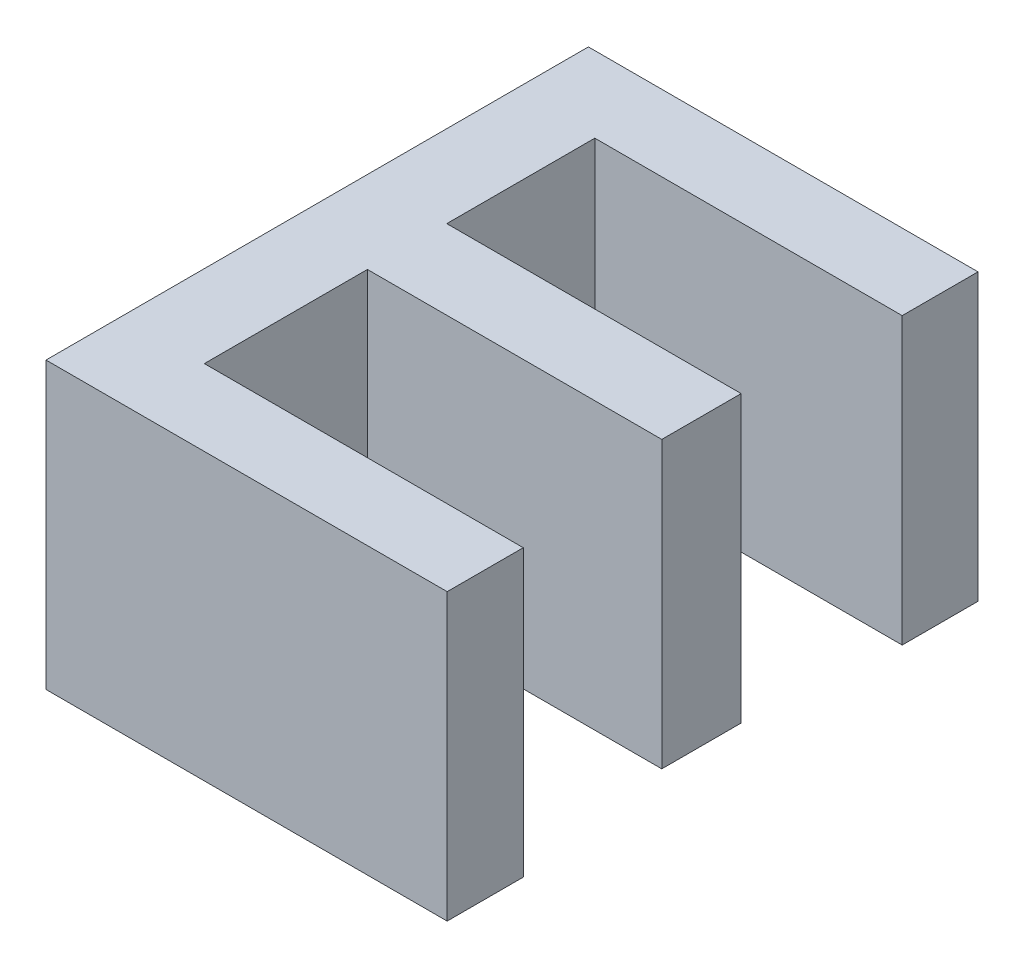
ISO-10303-21;
HEADER;
FILE_DESCRIPTION(('STEP AP214'),'2;1');
FILE_NAME('part.step','',(''),(''),'','','');
FILE_SCHEMA(('AUTOMOTIVE_DESIGN { 1 0 10303 214 1 1 1 1 }'));
ENDSEC;
DATA;
#1=APPLICATION_CONTEXT('core data for automotive mechanical design processes');
#2=APPLICATION_PROTOCOL_DEFINITION('international standard','automotive_design',2000,#1);
#3=PRODUCT_CONTEXT('',#1,'mechanical');
#4=PRODUCT('Part','Part','',(#3));
#5=PRODUCT_RELATED_PRODUCT_CATEGORY('part','',(#4));
#6=PRODUCT_DEFINITION_FORMATION('','',#4);
#7=PRODUCT_DEFINITION_CONTEXT('part definition',#1,'design');
#8=PRODUCT_DEFINITION('design','',#6,#7);
#9=PRODUCT_DEFINITION_SHAPE('','',#8);
#10=(LENGTH_UNIT() NAMED_UNIT(*) SI_UNIT(.MILLI.,.METRE.));
#11=(NAMED_UNIT(*) PLANE_ANGLE_UNIT() SI_UNIT($,.RADIAN.));
#12=(NAMED_UNIT(*) SI_UNIT($,.STERADIAN.) SOLID_ANGLE_UNIT());
#13=UNCERTAINTY_MEASURE_WITH_UNIT(LENGTH_MEASURE(1.E-05),#10,'distance_accuracy_value','');
#14=(GEOMETRIC_REPRESENTATION_CONTEXT(3) GLOBAL_UNCERTAINTY_ASSIGNED_CONTEXT((#13)) GLOBAL_UNIT_ASSIGNED_CONTEXT((#10,
#11,#12)) REPRESENTATION_CONTEXT('',''));
#15=CARTESIAN_POINT('',(0.,0.,0.));
#16=DIRECTION('',(0.,0.,1.));
#17=DIRECTION('',(1.,0.,0.));
#18=AXIS2_PLACEMENT_3D('',#15,#16,#17);
#19=CARTESIAN_POINT('',(78.3719416946208,10.,-58.9556493619376));
#20=DIRECTION('',(-1.,0.,0.));
#21=DIRECTION('',(0.,0.,1.));
#22=AXIS2_PLACEMENT_3D('',#19,#20,#21);
#23=PLANE('',#22);
#24=DIRECTION('',(0.,0.,-1.));
#25=VECTOR('',#24,1.);
#26=CARTESIAN_POINT('',(78.3719416946208,0.,-58.9556493619376));
#27=LINE('',#26,#25);
#28=CARTESIAN_POINT('',(78.3719416946208,0.,-56.28859622837));
#29=VERTEX_POINT('',#28);
#30=CARTESIAN_POINT('',(78.3719416946208,0.,-58.9556493619376));
#31=VERTEX_POINT('',#30);
#32=EDGE_CURVE('E150',#29,#31,#27,.T.);
#33=ORIENTED_EDGE('',*,*,#32,.T.);
#34=DIRECTION('',(0.,-1.,0.));
#35=VECTOR('',#34,1.);
#36=CARTESIAN_POINT('',(78.3719416946208,10.,-58.9556493619376));
#37=LINE('',#36,#35);
#38=CARTESIAN_POINT('',(78.3719416946208,10.,-58.9556493619376));
#39=VERTEX_POINT('',#38);
#40=EDGE_CURVE('E11',#39,#31,#37,.T.);
#41=ORIENTED_EDGE('',*,*,#40,.F.);
#42=DIRECTION('',(0.,0.,-1.));
#43=VECTOR('',#42,1.);
#44=CARTESIAN_POINT('',(78.3719416946208,10.,-58.9556493619376));
#45=LINE('',#44,#43);
#46=CARTESIAN_POINT('',(78.3719416946208,10.,-56.28859622837));
#47=VERTEX_POINT('',#46);
#48=EDGE_CURVE('E172',#47,#39,#45,.T.);
#49=ORIENTED_EDGE('',*,*,#48,.F.);
#50=DIRECTION('',(0.,-1.,0.));
#51=VECTOR('',#50,1.);
#52=CARTESIAN_POINT('',(78.3719416946208,10.,-56.28859622837));
#53=LINE('',#52,#51);
#54=EDGE_CURVE('E146',#47,#29,#53,.T.);
#55=ORIENTED_EDGE('',*,*,#54,.T.);
#56=EDGE_LOOP('',(#33,#41,#49,#55));
#57=FACE_BOUND('',#56,.T.);
#58=ADVANCED_FACE('F30',(#57),#23,.F.);
#59=CARTESIAN_POINT('',(67.1950137308941,10.,-58.9556493619376));
#60=DIRECTION('',(0.,0.,1.));
#61=DIRECTION('',(1.,0.,0.));
#62=AXIS2_PLACEMENT_3D('',#59,#60,#61);
#63=PLANE('',#62);
#64=DIRECTION('',(-1.,0.,0.));
#65=VECTOR('',#64,1.);
#66=CARTESIAN_POINT('',(67.1950137308941,0.,-58.9556493619376));
#67=LINE('',#66,#65);
#68=CARTESIAN_POINT('',(67.1950137308941,0.,-58.9556493619376));
#69=VERTEX_POINT('',#68);
#70=EDGE_CURVE('E153',#31,#69,#67,.T.);
#71=ORIENTED_EDGE('',*,*,#70,.T.);
#72=DIRECTION('',(0.,-1.,0.));
#73=VECTOR('',#72,1.);
#74=CARTESIAN_POINT('',(67.1950137308941,10.,-58.9556493619376));
#75=LINE('',#74,#73);
#76=CARTESIAN_POINT('',(67.1950137308941,10.,-58.9556493619376));
#77=VERTEX_POINT('',#76);
#78=EDGE_CURVE('E38',#77,#69,#75,.T.);
#79=ORIENTED_EDGE('',*,*,#78,.F.);
#80=DIRECTION('',(-1.,0.,0.));
#81=VECTOR('',#80,1.);
#82=CARTESIAN_POINT('',(67.1950137308941,10.,-58.9556493619376));
#83=LINE('',#82,#81);
#84=EDGE_CURVE('E101',#39,#77,#83,.T.);
#85=ORIENTED_EDGE('',*,*,#84,.F.);
#86=ORIENTED_EDGE('',*,*,#40,.T.);
#87=EDGE_LOOP('',(#71,#79,#85,#86));
#88=FACE_BOUND('',#87,.T.);
#89=ADVANCED_FACE('F250',(#88),#63,.F.);
#90=CARTESIAN_POINT('',(67.1950137308941,10.,-64.6705491804947));
#91=DIRECTION('',(-1.,0.,0.));
#92=DIRECTION('',(0.,0.,1.));
#93=AXIS2_PLACEMENT_3D('',#90,#91,#92);
#94=PLANE('',#93);
#95=DIRECTION('',(0.,0.,-1.));
#96=VECTOR('',#95,1.);
#97=CARTESIAN_POINT('',(67.1950137308941,0.,-64.6705491804947));
#98=LINE('',#97,#96);
#99=CARTESIAN_POINT('',(67.1950137308941,0.,-64.6705491804947));
#100=VERTEX_POINT('',#99);
#101=EDGE_CURVE('E155',#69,#100,#98,.T.);
#102=ORIENTED_EDGE('',*,*,#101,.T.);
#103=DIRECTION('',(0.,-1.,0.));
#104=VECTOR('',#103,1.);
#105=CARTESIAN_POINT('',(67.1950137308941,10.,-64.6705491804947));
#106=LINE('',#105,#104);
#107=CARTESIAN_POINT('',(67.1950137308941,10.,-64.6705491804947));
#108=VERTEX_POINT('',#107);
#109=EDGE_CURVE('E191',#108,#100,#106,.T.);
#110=ORIENTED_EDGE('',*,*,#109,.F.);
#111=DIRECTION('',(0.,0.,-1.));
#112=VECTOR('',#111,1.);
#113=CARTESIAN_POINT('',(67.1950137308941,10.,-64.6705491804947));
#114=LINE('',#113,#112);
#115=EDGE_CURVE('E199',#77,#108,#114,.T.);
#116=ORIENTED_EDGE('',*,*,#115,.F.);
#117=ORIENTED_EDGE('',*,*,#78,.T.);
#118=EDGE_LOOP('',(#102,#110,#116,#117));
#119=FACE_BOUND('',#118,.T.);
#120=ADVANCED_FACE('F197',(#119),#94,.F.);
#121=CARTESIAN_POINT('',(77.5121780051033,10.,-64.6705491804947));
#122=DIRECTION('',(0.,0.,-1.));
#123=DIRECTION('',(-1.,0.,0.));
#124=AXIS2_PLACEMENT_3D('',#121,#122,#123);
#125=PLANE('',#124);
#126=DIRECTION('',(1.,0.,0.));
#127=VECTOR('',#126,1.);
#128=CARTESIAN_POINT('',(77.5121780051033,0.,-64.6705491804947));
#129=LINE('',#128,#127);
#130=CARTESIAN_POINT('',(77.5121780051033,0.,-64.6705491804947));
#131=VERTEX_POINT('',#130);
#132=EDGE_CURVE('E157',#100,#131,#129,.T.);
#133=ORIENTED_EDGE('',*,*,#132,.T.);
#134=DIRECTION('',(0.,-1.,0.));
#135=VECTOR('',#134,1.);
#136=CARTESIAN_POINT('',(77.5121780051033,10.,-64.6705491804947));
#137=LINE('',#136,#135);
#138=CARTESIAN_POINT('',(77.5121780051033,10.,-64.6705491804947));
#139=VERTEX_POINT('',#138);
#140=EDGE_CURVE('E188',#139,#131,#137,.T.);
#141=ORIENTED_EDGE('',*,*,#140,.F.);
#142=DIRECTION('',(1.,0.,0.));
#143=VECTOR('',#142,1.);
#144=CARTESIAN_POINT('',(77.5121780051033,10.,-64.6705491804947));
#145=LINE('',#144,#143);
#146=EDGE_CURVE('E217',#108,#139,#145,.T.);
#147=ORIENTED_EDGE('',*,*,#146,.F.);
#148=ORIENTED_EDGE('',*,*,#109,.T.);
#149=EDGE_LOOP('',(#133,#141,#147,#148));
#150=FACE_BOUND('',#149,.T.);
#151=ADVANCED_FACE('F208',(#150),#125,.F.);
#152=CARTESIAN_POINT('',(77.5121780051033,10.,-67.452137587757));
#153=DIRECTION('',(-1.,0.,0.));
#154=DIRECTION('',(0.,0.,1.));
#155=AXIS2_PLACEMENT_3D('',#152,#153,#154);
#156=PLANE('',#155);
#157=DIRECTION('',(0.,0.,-1.));
#158=VECTOR('',#157,1.);
#159=CARTESIAN_POINT('',(77.5121780051033,0.,-67.452137587757));
#160=LINE('',#159,#158);
#161=CARTESIAN_POINT('',(77.5121780051033,0.,-67.452137587757));
#162=VERTEX_POINT('',#161);
#163=EDGE_CURVE('E159',#131,#162,#160,.T.);
#164=ORIENTED_EDGE('',*,*,#163,.T.);
#165=DIRECTION('',(0.,-1.,0.));
#166=VECTOR('',#165,1.);
#167=CARTESIAN_POINT('',(77.5121780051033,10.,-67.452137587757));
#168=LINE('',#167,#166);
#169=CARTESIAN_POINT('',(77.5121780051033,10.,-67.452137587757));
#170=VERTEX_POINT('',#169);
#171=EDGE_CURVE('E185',#170,#162,#168,.T.);
#172=ORIENTED_EDGE('',*,*,#171,.F.);
#173=DIRECTION('',(0.,0.,-1.));
#174=VECTOR('',#173,1.);
#175=CARTESIAN_POINT('',(77.5121780051033,10.,-67.452137587757));
#176=LINE('',#175,#174);
#177=EDGE_CURVE('E214',#139,#170,#176,.T.);
#178=ORIENTED_EDGE('',*,*,#177,.F.);
#179=ORIENTED_EDGE('',*,*,#140,.T.);
#180=EDGE_LOOP('',(#164,#172,#178,#179));
#181=FACE_BOUND('',#180,.T.);
#182=ADVANCED_FACE('F212',(#181),#156,.F.);
#183=CARTESIAN_POINT('',(67.1950137308941,10.,-67.452137587757));
#184=DIRECTION('',(0.,0.,1.));
#185=DIRECTION('',(1.,0.,0.));
#186=AXIS2_PLACEMENT_3D('',#183,#184,#185);
#187=PLANE('',#186);
#188=DIRECTION('',(-1.,0.,0.));
#189=VECTOR('',#188,1.);
#190=CARTESIAN_POINT('',(67.1950137308941,0.,-67.452137587757));
#191=LINE('',#190,#189);
#192=CARTESIAN_POINT('',(67.1950137308941,0.,-67.452137587757));
#193=VERTEX_POINT('',#192);
#194=EDGE_CURVE('E161',#162,#193,#191,.T.);
#195=ORIENTED_EDGE('',*,*,#194,.T.);
#196=DIRECTION('',(0.,-1.,0.));
#197=VECTOR('',#196,1.);
#198=CARTESIAN_POINT('',(67.1950137308941,10.,-67.452137587757));
#199=LINE('',#198,#197);
#200=CARTESIAN_POINT('',(67.1950137308941,10.,-67.452137587757));
#201=VERTEX_POINT('',#200);
#202=EDGE_CURVE('E182',#201,#193,#199,.T.);
#203=ORIENTED_EDGE('',*,*,#202,.F.);
#204=DIRECTION('',(-1.,0.,0.));
#205=VECTOR('',#204,1.);
#206=CARTESIAN_POINT('',(67.1950137308941,10.,-67.452137587757));
#207=LINE('',#206,#205);
#208=EDGE_CURVE('E216',#170,#201,#207,.T.);
#209=ORIENTED_EDGE('',*,*,#208,.F.);
#210=ORIENTED_EDGE('',*,*,#171,.T.);
#211=EDGE_LOOP('',(#195,#203,#209,#210));
#212=FACE_BOUND('',#211,.T.);
#213=ADVANCED_FACE('F263',(#212),#187,.F.);
#214=CARTESIAN_POINT('',(67.1950137308941,10.,-72.6404550002934));
#215=DIRECTION('',(-1.,0.,0.));
#216=DIRECTION('',(0.,0.,1.));
#217=AXIS2_PLACEMENT_3D('',#214,#215,#216);
#218=PLANE('',#217);
#219=DIRECTION('',(0.,0.,-1.));
#220=VECTOR('',#219,1.);
#221=CARTESIAN_POINT('',(67.1950137308941,0.,-72.6404550002934));
#222=LINE('',#221,#220);
#223=CARTESIAN_POINT('',(67.1950137308941,0.,-72.6404550002934));
#224=VERTEX_POINT('',#223);
#225=EDGE_CURVE('E163',#193,#224,#222,.T.);
#226=ORIENTED_EDGE('',*,*,#225,.T.);
#227=DIRECTION('',(0.,-1.,0.));
#228=VECTOR('',#227,1.);
#229=CARTESIAN_POINT('',(67.1950137308941,10.,-72.6404550002934));
#230=LINE('',#229,#228);
#231=CARTESIAN_POINT('',(67.1950137308941,10.,-72.6404550002934));
#232=VERTEX_POINT('',#231);
#233=EDGE_CURVE('E179',#232,#224,#230,.T.);
#234=ORIENTED_EDGE('',*,*,#233,.F.);
#235=DIRECTION('',(0.,0.,-1.));
#236=VECTOR('',#235,1.);
#237=CARTESIAN_POINT('',(67.1950137308941,10.,-72.6404550002934));
#238=LINE('',#237,#236);
#239=EDGE_CURVE('E219',#201,#232,#238,.T.);
#240=ORIENTED_EDGE('',*,*,#239,.F.);
#241=ORIENTED_EDGE('',*,*,#202,.T.);
#242=EDGE_LOOP('',(#226,#234,#240,#241));
#243=FACE_BOUND('',#242,.T.);
#244=ADVANCED_FACE('F266',(#243),#218,.F.);
#245=CARTESIAN_POINT('',(77.9673470172008,10.,-72.6404550002934));
#246=DIRECTION('',(0.,0.,-1.));
#247=DIRECTION('',(-1.,0.,0.));
#248=AXIS2_PLACEMENT_3D('',#245,#246,#247);
#249=PLANE('',#248);
#250=DIRECTION('',(1.,0.,0.));
#251=VECTOR('',#250,1.);
#252=CARTESIAN_POINT('',(77.9673470172008,0.,-72.6404550002934));
#253=LINE('',#252,#251);
#254=CARTESIAN_POINT('',(77.9673470172008,0.,-72.6404550002934));
#255=VERTEX_POINT('',#254);
#256=EDGE_CURVE('E165',#224,#255,#253,.T.);
#257=ORIENTED_EDGE('',*,*,#256,.T.);
#258=DIRECTION('',(0.,-1.,0.));
#259=VECTOR('',#258,1.);
#260=CARTESIAN_POINT('',(77.9673470172008,10.,-72.6404550002934));
#261=LINE('',#260,#259);
#262=CARTESIAN_POINT('',(77.9673470172008,10.,-72.6404550002934));
#263=VERTEX_POINT('',#262);
#264=EDGE_CURVE('E176',#263,#255,#261,.T.);
#265=ORIENTED_EDGE('',*,*,#264,.F.);
#266=DIRECTION('',(1.,0.,0.));
#267=VECTOR('',#266,1.);
#268=CARTESIAN_POINT('',(77.9673470172008,10.,-72.6404550002934));
#269=LINE('',#268,#267);
#270=EDGE_CURVE('E225',#232,#263,#269,.T.);
#271=ORIENTED_EDGE('',*,*,#270,.F.);
#272=ORIENTED_EDGE('',*,*,#233,.T.);
#273=EDGE_LOOP('',(#257,#265,#271,#272));
#274=FACE_BOUND('',#273,.T.);
#275=ADVANCED_FACE('F231',(#274),#249,.F.);
#276=CARTESIAN_POINT('',(77.9673470172008,10.,-75.2974570796293));
#277=DIRECTION('',(-1.,0.,0.));
#278=DIRECTION('',(0.,0.,1.));
#279=AXIS2_PLACEMENT_3D('',#276,#277,#278);
#280=PLANE('',#279);
#281=DIRECTION('',(0.,0.,-1.));
#282=VECTOR('',#281,1.);
#283=CARTESIAN_POINT('',(77.9673470172008,0.,-75.2974570796293));
#284=LINE('',#283,#282);
#285=CARTESIAN_POINT('',(77.9673470172008,0.,-75.2974570796293));
#286=VERTEX_POINT('',#285);
#287=EDGE_CURVE('E167',#255,#286,#284,.T.);
#288=ORIENTED_EDGE('',*,*,#287,.T.);
#289=DIRECTION('',(0.,-1.,0.));
#290=VECTOR('',#289,1.);
#291=CARTESIAN_POINT('',(77.9673470172008,10.,-75.2974570796293));
#292=LINE('',#291,#290);
#293=CARTESIAN_POINT('',(77.9673470172008,10.,-75.2974570796293));
#294=VERTEX_POINT('',#293);
#295=EDGE_CURVE('E141',#294,#286,#292,.T.);
#296=ORIENTED_EDGE('',*,*,#295,.F.);
#297=DIRECTION('',(0.,0.,-1.));
#298=VECTOR('',#297,1.);
#299=CARTESIAN_POINT('',(77.9673470172008,10.,-75.2974570796293));
#300=LINE('',#299,#298);
#301=EDGE_CURVE('E132',#263,#294,#300,.T.);
#302=ORIENTED_EDGE('',*,*,#301,.F.);
#303=ORIENTED_EDGE('',*,*,#264,.T.);
#304=EDGE_LOOP('',(#288,#296,#302,#303));
#305=FACE_BOUND('',#304,.T.);
#306=ADVANCED_FACE('F235',(#305),#280,.F.);
#307=CARTESIAN_POINT('',(64.3122766542768,10.,-75.2974570796293));
#308=DIRECTION('',(0.,0.,1.));
#309=DIRECTION('',(1.,0.,0.));
#310=AXIS2_PLACEMENT_3D('',#307,#308,#309);
#311=PLANE('',#310);
#312=DIRECTION('',(-1.,0.,0.));
#313=VECTOR('',#312,1.);
#314=CARTESIAN_POINT('',(64.3122766542768,0.,-75.2974570796293));
#315=LINE('',#314,#313);
#316=CARTESIAN_POINT('',(64.3122766542768,0.,-75.2974570796293));
#317=VERTEX_POINT('',#316);
#318=EDGE_CURVE('E140',#286,#317,#315,.T.);
#319=ORIENTED_EDGE('',*,*,#318,.T.);
#320=DIRECTION('',(0.,-1.,0.));
#321=VECTOR('',#320,1.);
#322=CARTESIAN_POINT('',(64.3122766542768,10.,-75.2974570796293));
#323=LINE('',#322,#321);
#324=CARTESIAN_POINT('',(64.3122766542768,10.,-75.2974570796293));
#325=VERTEX_POINT('',#324);
#326=EDGE_CURVE('E137',#325,#317,#323,.T.);
#327=ORIENTED_EDGE('',*,*,#326,.F.);
#328=DIRECTION('',(-1.,0.,0.));
#329=VECTOR('',#328,1.);
#330=CARTESIAN_POINT('',(64.3122766542768,10.,-75.2974570796293));
#331=LINE('',#330,#329);
#332=EDGE_CURVE('E126',#294,#325,#331,.T.);
#333=ORIENTED_EDGE('',*,*,#332,.F.);
#334=ORIENTED_EDGE('',*,*,#295,.T.);
#335=EDGE_LOOP('',(#319,#327,#333,#334));
#336=FACE_BOUND('',#335,.T.);
#337=ADVANCED_FACE('F138',(#336),#311,.F.);
#338=CARTESIAN_POINT('',(64.3122766542768,10.,-56.28859622837));
#339=DIRECTION('',(1.,0.,0.));
#340=DIRECTION('',(0.,0.,-1.));
#341=AXIS2_PLACEMENT_3D('',#338,#339,#340);
#342=PLANE('',#341);
#343=DIRECTION('',(0.,0.,1.));
#344=VECTOR('',#343,1.);
#345=CARTESIAN_POINT('',(64.3122766542768,0.,-56.28859622837));
#346=LINE('',#345,#344);
#347=CARTESIAN_POINT('',(64.3122766542768,0.,-56.28859622837));
#348=VERTEX_POINT('',#347);
#349=EDGE_CURVE('E87',#317,#348,#346,.T.);
#350=ORIENTED_EDGE('',*,*,#349,.T.);
#351=DIRECTION('',(0.,-1.,0.));
#352=VECTOR('',#351,1.);
#353=CARTESIAN_POINT('',(64.3122766542768,10.,-56.28859622837));
#354=LINE('',#353,#352);
#355=CARTESIAN_POINT('',(64.3122766542768,10.,-56.28859622837));
#356=VERTEX_POINT('',#355);
#357=EDGE_CURVE('E142',#356,#348,#354,.T.);
#358=ORIENTED_EDGE('',*,*,#357,.F.);
#359=DIRECTION('',(0.,0.,1.));
#360=VECTOR('',#359,1.);
#361=CARTESIAN_POINT('',(64.3122766542768,10.,-56.28859622837));
#362=LINE('',#361,#360);
#363=EDGE_CURVE('E130',#325,#356,#362,.T.);
#364=ORIENTED_EDGE('',*,*,#363,.F.);
#365=ORIENTED_EDGE('',*,*,#326,.T.);
#366=EDGE_LOOP('',(#350,#358,#364,#365));
#367=FACE_BOUND('',#366,.T.);
#368=ADVANCED_FACE('F144',(#367),#342,.F.);
#369=CARTESIAN_POINT('',(78.3719416946208,10.,-56.28859622837));
#370=DIRECTION('',(0.,0.,-1.));
#371=DIRECTION('',(-1.,0.,0.));
#372=AXIS2_PLACEMENT_3D('',#369,#370,#371);
#373=PLANE('',#372);
#374=DIRECTION('',(1.,0.,0.));
#375=VECTOR('',#374,1.);
#376=CARTESIAN_POINT('',(78.3719416946208,0.,-56.28859622837));
#377=LINE('',#376,#375);
#378=EDGE_CURVE('E93',#348,#29,#377,.T.);
#379=ORIENTED_EDGE('',*,*,#378,.T.);
#380=ORIENTED_EDGE('',*,*,#54,.F.);
#381=DIRECTION('',(1.,0.,0.));
#382=VECTOR('',#381,1.);
#383=CARTESIAN_POINT('',(78.3719416946208,10.,-56.28859622837));
#384=LINE('',#383,#382);
#385=EDGE_CURVE('E46',#356,#47,#384,.T.);
#386=ORIENTED_EDGE('',*,*,#385,.F.);
#387=ORIENTED_EDGE('',*,*,#357,.T.);
#388=EDGE_LOOP('',(#379,#380,#386,#387));
#389=FACE_BOUND('',#388,.T.);
#390=ADVANCED_FACE('F239',(#389),#373,.F.);
#391=CARTESIAN_POINT('',(0.,10.,0.));
#392=DIRECTION('',(0.,-1.,0.));
#393=DIRECTION('',(0.,0.,-1.));
#394=AXIS2_PLACEMENT_3D('',#391,#392,#393);
#395=PLANE('',#394);
#396=ORIENTED_EDGE('',*,*,#48,.T.);
#397=ORIENTED_EDGE('',*,*,#84,.T.);
#398=ORIENTED_EDGE('',*,*,#115,.T.);
#399=ORIENTED_EDGE('',*,*,#146,.T.);
#400=ORIENTED_EDGE('',*,*,#177,.T.);
#401=ORIENTED_EDGE('',*,*,#208,.T.);
#402=ORIENTED_EDGE('',*,*,#239,.T.);
#403=ORIENTED_EDGE('',*,*,#270,.T.);
#404=ORIENTED_EDGE('',*,*,#301,.T.);
#405=ORIENTED_EDGE('',*,*,#332,.T.);
#406=ORIENTED_EDGE('',*,*,#363,.T.);
#407=ORIENTED_EDGE('',*,*,#385,.T.);
#408=EDGE_LOOP('',(#396,#397,#398,#399,#400,#401,#402,#403,#404,#405,#406,#407));
#409=FACE_BOUND('',#408,.T.);
#410=ADVANCED_FACE('F128',(#409),#395,.F.);
#411=CARTESIAN_POINT('',(0.,0.,0.));
#412=DIRECTION('',(0.,-1.,0.));
#413=DIRECTION('',(0.,0.,-1.));
#414=AXIS2_PLACEMENT_3D('',#411,#412,#413);
#415=PLANE('',#414);
#416=ORIENTED_EDGE('',*,*,#32,.F.);
#417=ORIENTED_EDGE('',*,*,#378,.F.);
#418=ORIENTED_EDGE('',*,*,#349,.F.);
#419=ORIENTED_EDGE('',*,*,#318,.F.);
#420=ORIENTED_EDGE('',*,*,#287,.F.);
#421=ORIENTED_EDGE('',*,*,#256,.F.);
#422=ORIENTED_EDGE('',*,*,#225,.F.);
#423=ORIENTED_EDGE('',*,*,#194,.F.);
#424=ORIENTED_EDGE('',*,*,#163,.F.);
#425=ORIENTED_EDGE('',*,*,#132,.F.);
#426=ORIENTED_EDGE('',*,*,#101,.F.);
#427=ORIENTED_EDGE('',*,*,#70,.F.);
#428=EDGE_LOOP('',(#416,#417,#418,#419,#420,#421,#422,#423,#424,#425,#426,#427));
#429=FACE_BOUND('',#428,.T.);
#430=ADVANCED_FACE('F203',(#429),#415,.T.);
#431=CLOSED_SHELL('',(#58,#89,#120,#151,#182,#213,#244,#275,#306,#337,#368,#390,#410,#430));
#432=MANIFOLD_SOLID_BREP('B2',#431);
#433=ADVANCED_BREP_SHAPE_REPRESENTATION('',(#18,#432),#14);
#434=SHAPE_DEFINITION_REPRESENTATION(#9,#433);
ENDSEC;
END-ISO-10303-21;
